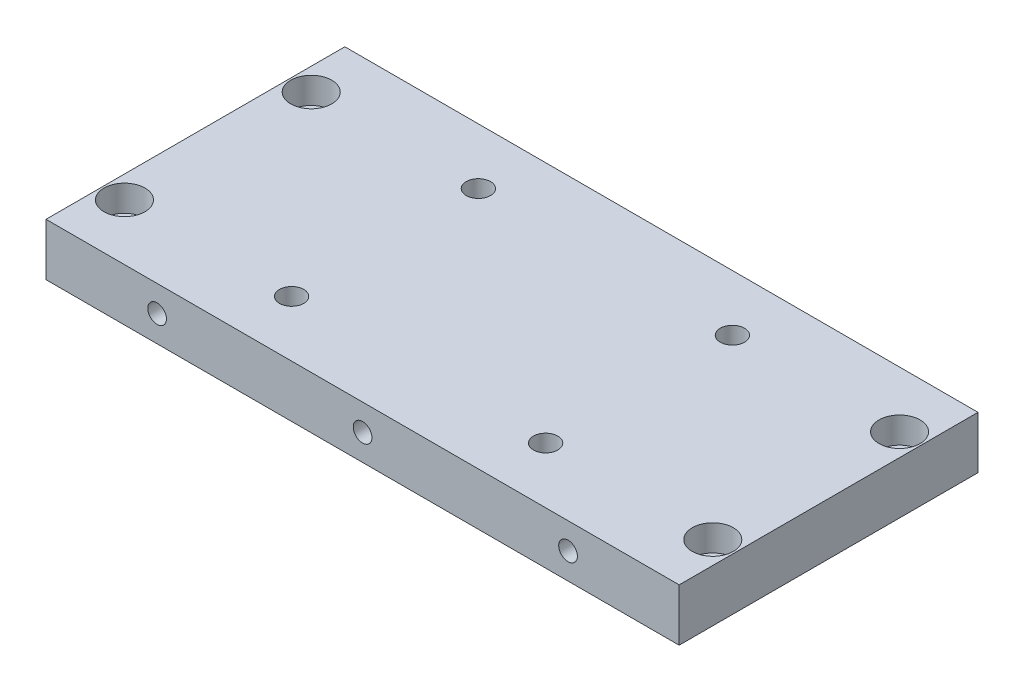
ISO-10303-21;
HEADER;
FILE_DESCRIPTION(('STEP AP214'),'2;1');
FILE_NAME('part.step','',(''),(''),'','','');
FILE_SCHEMA(('AUTOMOTIVE_DESIGN { 1 0 10303 214 1 1 1 1 }'));
ENDSEC;
DATA;
#1=APPLICATION_CONTEXT('core data for automotive mechanical design processes');
#2=APPLICATION_PROTOCOL_DEFINITION('international standard','automotive_design',2000,#1);
#3=PRODUCT_CONTEXT('',#1,'mechanical');
#4=PRODUCT('Part','Part','',(#3));
#5=PRODUCT_RELATED_PRODUCT_CATEGORY('part','',(#4));
#6=PRODUCT_DEFINITION_FORMATION('','',#4);
#7=PRODUCT_DEFINITION_CONTEXT('part definition',#1,'design');
#8=PRODUCT_DEFINITION('design','',#6,#7);
#9=PRODUCT_DEFINITION_SHAPE('','',#8);
#10=(LENGTH_UNIT() NAMED_UNIT(*) SI_UNIT(.MILLI.,.METRE.));
#11=(NAMED_UNIT(*) PLANE_ANGLE_UNIT() SI_UNIT($,.RADIAN.));
#12=(NAMED_UNIT(*) SI_UNIT($,.STERADIAN.) SOLID_ANGLE_UNIT());
#13=UNCERTAINTY_MEASURE_WITH_UNIT(LENGTH_MEASURE(1.E-05),#10,'distance_accuracy_value','');
#14=(GEOMETRIC_REPRESENTATION_CONTEXT(3) GLOBAL_UNCERTAINTY_ASSIGNED_CONTEXT((#13)) GLOBAL_UNIT_ASSIGNED_CONTEXT((#10,
#11,#12)) REPRESENTATION_CONTEXT('',''));
#15=CARTESIAN_POINT('',(0.,0.,0.));
#16=DIRECTION('',(0.,0.,1.));
#17=DIRECTION('',(1.,0.,0.));
#18=AXIS2_PLACEMENT_3D('',#15,#16,#17);
#19=CARTESIAN_POINT('',(55.,7.,23.9999999998872));
#20=DIRECTION('',(0.,0.,1.));
#21=DIRECTION('',(1.,0.,0.));
#22=AXIS2_PLACEMENT_3D('',#19,#20,#21);
#23=CONICAL_SURFACE('',#22,2.49999999989086,1.02974425861408);
#24=CARTESIAN_POINT('',(55.0000000002058,7.,22.4978484523604));
#25=VERTEX_POINT('',#24);
#26=VERTEX_LOOP('',#25);
#27=FACE_BOUND('',#26,.T.);
#28=CARTESIAN_POINT('',(55.,7.,24.));
#29=DIRECTION('',(0.,0.,1.));
#30=DIRECTION('',(1.,0.,0.));
#31=AXIS2_PLACEMENT_3D('',#28,#29,#30);
#32=CIRCLE('',#31,2.5);
#33=CARTESIAN_POINT('',(57.5,7.,24.));
#34=VERTEX_POINT('',#33);
#35=EDGE_CURVE('E69',#34,#34,#32,.T.);
#36=ORIENTED_EDGE('',*,*,#35,.T.);
#37=EDGE_LOOP('',(#36));
#38=FACE_BOUND('',#37,.T.);
#39=ADVANCED_FACE('F17',(#27,#38),#23,.F.);
#40=CARTESIAN_POINT('',(0.,7.,23.9999999999441));
#41=DIRECTION('',(0.,0.,1.));
#42=DIRECTION('',(1.,0.,0.));
#43=AXIS2_PLACEMENT_3D('',#40,#41,#42);
#44=CONICAL_SURFACE('',#43,2.49999999982219,1.02974425853634);
#45=CARTESIAN_POINT('',(0.,7.,22.4978484523604));
#46=VERTEX_POINT('',#45);
#47=VERTEX_LOOP('',#46);
#48=FACE_BOUND('',#47,.T.);
#49=CARTESIAN_POINT('',(0.,7.,24.));
#50=DIRECTION('',(0.,0.,1.));
#51=DIRECTION('',(1.,0.,0.));
#52=AXIS2_PLACEMENT_3D('',#49,#50,#51);
#53=CIRCLE('',#52,2.5);
#54=CARTESIAN_POINT('',(2.49999999999994,7.,24.));
#55=VERTEX_POINT('',#54);
#56=EDGE_CURVE('E71',#55,#55,#53,.T.);
#57=ORIENTED_EDGE('',*,*,#56,.T.);
#58=EDGE_LOOP('',(#57));
#59=FACE_BOUND('',#58,.T.);
#60=ADVANCED_FACE('F66',(#48,#59),#44,.F.);
#61=CARTESIAN_POINT('',(-55.,7.,24.0000000000578));
#62=DIRECTION('',(0.,0.,1.));
#63=DIRECTION('',(1.,0.,0.));
#64=AXIS2_PLACEMENT_3D('',#61,#62,#63);
#65=CONICAL_SURFACE('',#64,2.50000000016325,1.02974425866684);
#66=CARTESIAN_POINT('',(-55.,7.,22.4978484523604));
#67=VERTEX_POINT('',#66);
#68=VERTEX_LOOP('',#67);
#69=FACE_BOUND('',#68,.T.);
#70=CARTESIAN_POINT('',(-55.,7.,24.));
#71=DIRECTION('',(0.,0.,1.));
#72=DIRECTION('',(1.,0.,0.));
#73=AXIS2_PLACEMENT_3D('',#70,#71,#72);
#74=CIRCLE('',#73,2.5);
#75=CARTESIAN_POINT('',(-52.5,7.,24.));
#76=VERTEX_POINT('',#75);
#77=EDGE_CURVE('E75',#76,#76,#74,.T.);
#78=ORIENTED_EDGE('',*,*,#77,.T.);
#79=EDGE_LOOP('',(#78));
#80=FACE_BOUND('',#79,.T.);
#81=ADVANCED_FACE('F222',(#69,#80),#65,.F.);
#82=CARTESIAN_POINT('',(-34.,14.,25.));
#83=DIRECTION('',(0.,-1.,0.));
#84=DIRECTION('',(0.,0.,-1.));
#85=AXIS2_PLACEMENT_3D('',#82,#83,#84);
#86=CYLINDRICAL_SURFACE('',#85,3.25);
#87=CARTESIAN_POINT('',(-34.,7.,25.));
#88=DIRECTION('',(0.,-1.,0.));
#89=DIRECTION('',(0.,0.,-1.));
#90=AXIS2_PLACEMENT_3D('',#87,#88,#89);
#91=CIRCLE('',#90,3.25);
#92=CARTESIAN_POINT('',(-34.,7.,21.75));
#93=VERTEX_POINT('',#92);
#94=EDGE_CURVE('E173',#93,#93,#91,.F.);
#95=ORIENTED_EDGE('',*,*,#94,.F.);
#96=EDGE_LOOP('',(#95));
#97=FACE_BOUND('',#96,.T.);
#98=CARTESIAN_POINT('',(-34.,14.,25.));
#99=DIRECTION('',(0.,-1.,0.));
#100=DIRECTION('',(0.,0.,-1.));
#101=AXIS2_PLACEMENT_3D('',#98,#99,#100);
#102=CIRCLE('',#101,3.25);
#103=CARTESIAN_POINT('',(-34.,14.,21.75));
#104=VERTEX_POINT('',#103);
#105=EDGE_CURVE('E165',#104,#104,#102,.F.);
#106=ORIENTED_EDGE('',*,*,#105,.T.);
#107=EDGE_LOOP('',(#106));
#108=FACE_BOUND('',#107,.T.);
#109=ADVANCED_FACE('F219',(#97,#108),#86,.F.);
#110=CARTESIAN_POINT('',(-34.,14.,-25.));
#111=DIRECTION('',(0.,-1.,0.));
#112=DIRECTION('',(0.,0.,-1.));
#113=AXIS2_PLACEMENT_3D('',#110,#111,#112);
#114=CYLINDRICAL_SURFACE('',#113,3.25);
#115=CARTESIAN_POINT('',(-34.,7.,-25.));
#116=DIRECTION('',(0.,-1.,0.));
#117=DIRECTION('',(0.,0.,-1.));
#118=AXIS2_PLACEMENT_3D('',#115,#116,#117);
#119=CIRCLE('',#118,3.25);
#120=CARTESIAN_POINT('',(-34.,7.,-28.25));
#121=VERTEX_POINT('',#120);
#122=EDGE_CURVE('E78',#121,#121,#119,.F.);
#123=ORIENTED_EDGE('',*,*,#122,.F.);
#124=EDGE_LOOP('',(#123));
#125=FACE_BOUND('',#124,.T.);
#126=CARTESIAN_POINT('',(-34.,14.,-25.));
#127=DIRECTION('',(0.,-1.,0.));
#128=DIRECTION('',(0.,0.,-1.));
#129=AXIS2_PLACEMENT_3D('',#126,#127,#128);
#130=CIRCLE('',#129,3.25);
#131=CARTESIAN_POINT('',(-34.,14.,-28.25));
#132=VERTEX_POINT('',#131);
#133=EDGE_CURVE('E162',#132,#132,#130,.F.);
#134=ORIENTED_EDGE('',*,*,#133,.T.);
#135=EDGE_LOOP('',(#134));
#136=FACE_BOUND('',#135,.T.);
#137=ADVANCED_FACE('F221',(#125,#136),#114,.F.);
#138=CARTESIAN_POINT('',(34.,14.,-25.));
#139=DIRECTION('',(0.,-1.,0.));
#140=DIRECTION('',(0.,0.,-1.));
#141=AXIS2_PLACEMENT_3D('',#138,#139,#140);
#142=CYLINDRICAL_SURFACE('',#141,3.25);
#143=CARTESIAN_POINT('',(34.,7.,-25.));
#144=DIRECTION('',(0.,-1.,0.));
#145=DIRECTION('',(0.,0.,-1.));
#146=AXIS2_PLACEMENT_3D('',#143,#144,#145);
#147=CIRCLE('',#146,3.25);
#148=CARTESIAN_POINT('',(34.,7.,-28.25));
#149=VERTEX_POINT('',#148);
#150=EDGE_CURVE('E72',#149,#149,#147,.F.);
#151=ORIENTED_EDGE('',*,*,#150,.F.);
#152=EDGE_LOOP('',(#151));
#153=FACE_BOUND('',#152,.T.);
#154=CARTESIAN_POINT('',(34.,14.,-25.));
#155=DIRECTION('',(0.,-1.,0.));
#156=DIRECTION('',(0.,0.,-1.));
#157=AXIS2_PLACEMENT_3D('',#154,#155,#156);
#158=CIRCLE('',#157,3.25);
#159=CARTESIAN_POINT('',(34.,14.,-28.25));
#160=VERTEX_POINT('',#159);
#161=EDGE_CURVE('E159',#160,#160,#158,.F.);
#162=ORIENTED_EDGE('',*,*,#161,.T.);
#163=EDGE_LOOP('',(#162));
#164=FACE_BOUND('',#163,.T.);
#165=ADVANCED_FACE('F230',(#153,#164),#142,.F.);
#166=CARTESIAN_POINT('',(34.,14.,25.));
#167=DIRECTION('',(0.,-1.,0.));
#168=DIRECTION('',(0.,0.,-1.));
#169=AXIS2_PLACEMENT_3D('',#166,#167,#168);
#170=CYLINDRICAL_SURFACE('',#169,3.25);
#171=CARTESIAN_POINT('',(34.,7.,25.));
#172=DIRECTION('',(0.,-1.,0.));
#173=DIRECTION('',(0.,0.,-1.));
#174=AXIS2_PLACEMENT_3D('',#171,#172,#173);
#175=CIRCLE('',#174,3.25);
#176=CARTESIAN_POINT('',(34.,7.,21.75));
#177=VERTEX_POINT('',#176);
#178=EDGE_CURVE('E170',#177,#177,#175,.F.);
#179=ORIENTED_EDGE('',*,*,#178,.F.);
#180=EDGE_LOOP('',(#179));
#181=FACE_BOUND('',#180,.T.);
#182=CARTESIAN_POINT('',(34.,14.,25.));
#183=DIRECTION('',(0.,-1.,0.));
#184=DIRECTION('',(0.,0.,-1.));
#185=AXIS2_PLACEMENT_3D('',#182,#183,#184);
#186=CIRCLE('',#185,3.25);
#187=CARTESIAN_POINT('',(34.,14.,21.75));
#188=VERTEX_POINT('',#187);
#189=EDGE_CURVE('E156',#188,#188,#186,.F.);
#190=ORIENTED_EDGE('',*,*,#189,.T.);
#191=EDGE_LOOP('',(#190));
#192=FACE_BOUND('',#191,.T.);
#193=ADVANCED_FACE('F340',(#181,#192),#170,.F.);
#194=CARTESIAN_POINT('',(-78.75,7.,-25.));
#195=DIRECTION('',(0.,1.,0.));
#196=DIRECTION('',(0.,0.,1.));
#197=AXIS2_PLACEMENT_3D('',#194,#195,#196);
#198=CYLINDRICAL_SURFACE('',#197,5.5);
#199=CARTESIAN_POINT('',(-78.75,7.,-25.));
#200=DIRECTION('',(0.,1.,0.));
#201=DIRECTION('',(0.,0.,1.));
#202=AXIS2_PLACEMENT_3D('',#199,#200,#201);
#203=CIRCLE('',#202,5.5);
#204=CARTESIAN_POINT('',(-78.75,7.,-19.5));
#205=VERTEX_POINT('',#204);
#206=EDGE_CURVE('E179',#205,#205,#203,.T.);
#207=ORIENTED_EDGE('',*,*,#206,.F.);
#208=EDGE_LOOP('',(#207));
#209=FACE_BOUND('',#208,.T.);
#210=CARTESIAN_POINT('',(-78.75,14.,-25.));
#211=DIRECTION('',(0.,1.,0.));
#212=DIRECTION('',(0.,0.,1.));
#213=AXIS2_PLACEMENT_3D('',#210,#211,#212);
#214=CIRCLE('',#213,5.5);
#215=CARTESIAN_POINT('',(-78.75,14.,-19.5));
#216=VERTEX_POINT('',#215);
#217=EDGE_CURVE('E153',#216,#216,#214,.T.);
#218=ORIENTED_EDGE('',*,*,#217,.T.);
#219=EDGE_LOOP('',(#218));
#220=FACE_BOUND('',#219,.T.);
#221=ADVANCED_FACE('F336',(#209,#220),#198,.F.);
#222=CARTESIAN_POINT('',(-78.75,7.,25.));
#223=DIRECTION('',(0.,1.,0.));
#224=DIRECTION('',(0.,0.,1.));
#225=AXIS2_PLACEMENT_3D('',#222,#223,#224);
#226=CYLINDRICAL_SURFACE('',#225,5.5);
#227=CARTESIAN_POINT('',(-78.75,7.,25.));
#228=DIRECTION('',(0.,1.,0.));
#229=DIRECTION('',(0.,0.,1.));
#230=AXIS2_PLACEMENT_3D('',#227,#228,#229);
#231=CIRCLE('',#230,5.5);
#232=CARTESIAN_POINT('',(-78.75,7.,30.5));
#233=VERTEX_POINT('',#232);
#234=EDGE_CURVE('E176',#233,#233,#231,.T.);
#235=ORIENTED_EDGE('',*,*,#234,.F.);
#236=EDGE_LOOP('',(#235));
#237=FACE_BOUND('',#236,.T.);
#238=CARTESIAN_POINT('',(-78.75,14.,25.));
#239=DIRECTION('',(0.,1.,0.));
#240=DIRECTION('',(0.,0.,1.));
#241=AXIS2_PLACEMENT_3D('',#238,#239,#240);
#242=CIRCLE('',#241,5.5);
#243=CARTESIAN_POINT('',(-78.75,14.,30.5));
#244=VERTEX_POINT('',#243);
#245=EDGE_CURVE('E150',#244,#244,#242,.T.);
#246=ORIENTED_EDGE('',*,*,#245,.T.);
#247=EDGE_LOOP('',(#246));
#248=FACE_BOUND('',#247,.T.);
#249=ADVANCED_FACE('F332',(#237,#248),#226,.F.);
#250=CARTESIAN_POINT('',(78.75,7.,-25.));
#251=DIRECTION('',(0.,1.,0.));
#252=DIRECTION('',(0.,0.,1.));
#253=AXIS2_PLACEMENT_3D('',#250,#251,#252);
#254=CYLINDRICAL_SURFACE('',#253,5.5);
#255=CARTESIAN_POINT('',(78.75,7.,-25.));
#256=DIRECTION('',(0.,1.,0.));
#257=DIRECTION('',(0.,0.,1.));
#258=AXIS2_PLACEMENT_3D('',#255,#256,#257);
#259=CIRCLE('',#258,5.5);
#260=CARTESIAN_POINT('',(78.75,7.,-19.5));
#261=VERTEX_POINT('',#260);
#262=EDGE_CURVE('E181',#261,#261,#259,.T.);
#263=ORIENTED_EDGE('',*,*,#262,.F.);
#264=EDGE_LOOP('',(#263));
#265=FACE_BOUND('',#264,.T.);
#266=CARTESIAN_POINT('',(78.75,14.,-25.));
#267=DIRECTION('',(0.,1.,0.));
#268=DIRECTION('',(0.,0.,1.));
#269=AXIS2_PLACEMENT_3D('',#266,#267,#268);
#270=CIRCLE('',#269,5.5);
#271=CARTESIAN_POINT('',(78.75,14.,-19.5));
#272=VERTEX_POINT('',#271);
#273=EDGE_CURVE('E147',#272,#272,#270,.T.);
#274=ORIENTED_EDGE('',*,*,#273,.T.);
#275=EDGE_LOOP('',(#274));
#276=FACE_BOUND('',#275,.T.);
#277=ADVANCED_FACE('F194',(#265,#276),#254,.F.);
#278=CARTESIAN_POINT('',(78.75,7.,25.));
#279=DIRECTION('',(0.,1.,0.));
#280=DIRECTION('',(0.,0.,1.));
#281=AXIS2_PLACEMENT_3D('',#278,#279,#280);
#282=CYLINDRICAL_SURFACE('',#281,5.5);
#283=CARTESIAN_POINT('',(78.75,7.,25.));
#284=DIRECTION('',(0.,1.,0.));
#285=DIRECTION('',(0.,0.,1.));
#286=AXIS2_PLACEMENT_3D('',#283,#284,#285);
#287=CIRCLE('',#286,5.5);
#288=CARTESIAN_POINT('',(78.75,7.,30.5));
#289=VERTEX_POINT('',#288);
#290=EDGE_CURVE('E20',#289,#289,#287,.T.);
#291=ORIENTED_EDGE('',*,*,#290,.F.);
#292=EDGE_LOOP('',(#291));
#293=FACE_BOUND('',#292,.T.);
#294=CARTESIAN_POINT('',(78.75,14.,25.));
#295=DIRECTION('',(0.,1.,0.));
#296=DIRECTION('',(0.,0.,1.));
#297=AXIS2_PLACEMENT_3D('',#294,#295,#296);
#298=CIRCLE('',#297,5.5);
#299=CARTESIAN_POINT('',(78.75,14.,30.5));
#300=VERTEX_POINT('',#299);
#301=EDGE_CURVE('E144',#300,#300,#298,.T.);
#302=ORIENTED_EDGE('',*,*,#301,.T.);
#303=EDGE_LOOP('',(#302));
#304=FACE_BOUND('',#303,.T.);
#305=ADVANCED_FACE('F191',(#293,#304),#282,.F.);
#306=CARTESIAN_POINT('',(78.75,7.,25.));
#307=DIRECTION('',(0.,1.,0.));
#308=DIRECTION('',(0.,0.,1.));
#309=AXIS2_PLACEMENT_3D('',#306,#307,#308);
#310=PLANE('',#309);
#311=ORIENTED_EDGE('',*,*,#290,.T.);
#312=EDGE_LOOP('',(#311));
#313=FACE_BOUND('',#312,.T.);
#314=CARTESIAN_POINT('',(78.75,7.,25.));
#315=DIRECTION('',(0.,-1.,0.));
#316=DIRECTION('',(0.,0.,-1.));
#317=AXIS2_PLACEMENT_3D('',#314,#315,#316);
#318=CIRCLE('',#317,3.25);
#319=CARTESIAN_POINT('',(78.75,7.,21.75));
#320=VERTEX_POINT('',#319);
#321=EDGE_CURVE('E141',#320,#320,#318,.T.);
#322=ORIENTED_EDGE('',*,*,#321,.T.);
#323=EDGE_LOOP('',(#322));
#324=FACE_BOUND('',#323,.T.);
#325=ADVANCED_FACE('F188',(#313,#324),#310,.T.);
#326=CARTESIAN_POINT('',(78.75,7.,-25.));
#327=DIRECTION('',(0.,1.,0.));
#328=DIRECTION('',(0.,0.,1.));
#329=AXIS2_PLACEMENT_3D('',#326,#327,#328);
#330=PLANE('',#329);
#331=ORIENTED_EDGE('',*,*,#262,.T.);
#332=EDGE_LOOP('',(#331));
#333=FACE_BOUND('',#332,.T.);
#334=CARTESIAN_POINT('',(78.75,7.,-25.));
#335=DIRECTION('',(0.,-1.,0.));
#336=DIRECTION('',(0.,0.,-1.));
#337=AXIS2_PLACEMENT_3D('',#334,#335,#336);
#338=CIRCLE('',#337,3.25);
#339=CARTESIAN_POINT('',(78.75,7.,-28.25));
#340=VERTEX_POINT('',#339);
#341=EDGE_CURVE('E138',#340,#340,#338,.T.);
#342=ORIENTED_EDGE('',*,*,#341,.T.);
#343=EDGE_LOOP('',(#342));
#344=FACE_BOUND('',#343,.T.);
#345=ADVANCED_FACE('F324',(#333,#344),#330,.T.);
#346=CARTESIAN_POINT('',(-78.75,7.,-25.));
#347=DIRECTION('',(0.,1.,0.));
#348=DIRECTION('',(0.,0.,1.));
#349=AXIS2_PLACEMENT_3D('',#346,#347,#348);
#350=PLANE('',#349);
#351=ORIENTED_EDGE('',*,*,#206,.T.);
#352=EDGE_LOOP('',(#351));
#353=FACE_BOUND('',#352,.T.);
#354=CARTESIAN_POINT('',(-78.75,7.,-25.));
#355=DIRECTION('',(0.,-1.,0.));
#356=DIRECTION('',(0.,0.,-1.));
#357=AXIS2_PLACEMENT_3D('',#354,#355,#356);
#358=CIRCLE('',#357,3.25);
#359=CARTESIAN_POINT('',(-78.75,7.,-28.25));
#360=VERTEX_POINT('',#359);
#361=EDGE_CURVE('E135',#360,#360,#358,.T.);
#362=ORIENTED_EDGE('',*,*,#361,.T.);
#363=EDGE_LOOP('',(#362));
#364=FACE_BOUND('',#363,.T.);
#365=ADVANCED_FACE('F320',(#353,#364),#350,.T.);
#366=CARTESIAN_POINT('',(-78.75,7.,25.));
#367=DIRECTION('',(0.,1.,0.));
#368=DIRECTION('',(0.,0.,1.));
#369=AXIS2_PLACEMENT_3D('',#366,#367,#368);
#370=PLANE('',#369);
#371=ORIENTED_EDGE('',*,*,#234,.T.);
#372=EDGE_LOOP('',(#371));
#373=FACE_BOUND('',#372,.T.);
#374=CARTESIAN_POINT('',(-78.75,7.,25.));
#375=DIRECTION('',(0.,-1.,0.));
#376=DIRECTION('',(0.,0.,-1.));
#377=AXIS2_PLACEMENT_3D('',#374,#375,#376);
#378=CIRCLE('',#377,3.25);
#379=CARTESIAN_POINT('',(-78.75,7.,21.75));
#380=VERTEX_POINT('',#379);
#381=EDGE_CURVE('E132',#380,#380,#378,.T.);
#382=ORIENTED_EDGE('',*,*,#381,.T.);
#383=EDGE_LOOP('',(#382));
#384=FACE_BOUND('',#383,.T.);
#385=ADVANCED_FACE('F316',(#373,#384),#370,.T.);
#386=CARTESIAN_POINT('',(-34.,7.,25.));
#387=DIRECTION('',(0.,-1.,0.));
#388=DIRECTION('',(0.,0.,-1.));
#389=AXIS2_PLACEMENT_3D('',#386,#387,#388);
#390=PLANE('',#389);
#391=CARTESIAN_POINT('',(-34.,7.,25.));
#392=DIRECTION('',(0.,-1.,0.));
#393=DIRECTION('',(0.,0.,-1.));
#394=AXIS2_PLACEMENT_3D('',#391,#392,#393);
#395=CIRCLE('',#394,5.5);
#396=CARTESIAN_POINT('',(-34.,7.,19.5));
#397=VERTEX_POINT('',#396);
#398=EDGE_CURVE('E129',#397,#397,#395,.T.);
#399=ORIENTED_EDGE('',*,*,#398,.T.);
#400=EDGE_LOOP('',(#399));
#401=FACE_BOUND('',#400,.T.);
#402=ORIENTED_EDGE('',*,*,#94,.T.);
#403=EDGE_LOOP('',(#402));
#404=FACE_BOUND('',#403,.T.);
#405=ADVANCED_FACE('F312',(#401,#404),#390,.T.);
#406=CARTESIAN_POINT('',(34.,7.,25.));
#407=DIRECTION('',(0.,-1.,0.));
#408=DIRECTION('',(0.,0.,-1.));
#409=AXIS2_PLACEMENT_3D('',#406,#407,#408);
#410=PLANE('',#409);
#411=CARTESIAN_POINT('',(34.,7.,25.));
#412=DIRECTION('',(0.,-1.,0.));
#413=DIRECTION('',(0.,0.,-1.));
#414=AXIS2_PLACEMENT_3D('',#411,#412,#413);
#415=CIRCLE('',#414,5.5);
#416=CARTESIAN_POINT('',(34.,7.,19.5));
#417=VERTEX_POINT('',#416);
#418=EDGE_CURVE('E126',#417,#417,#415,.T.);
#419=ORIENTED_EDGE('',*,*,#418,.T.);
#420=EDGE_LOOP('',(#419));
#421=FACE_BOUND('',#420,.T.);
#422=ORIENTED_EDGE('',*,*,#178,.T.);
#423=EDGE_LOOP('',(#422));
#424=FACE_BOUND('',#423,.T.);
#425=ADVANCED_FACE('F308',(#421,#424),#410,.T.);
#426=CARTESIAN_POINT('',(-34.,7.,-25.));
#427=DIRECTION('',(0.,-1.,0.));
#428=DIRECTION('',(0.,0.,-1.));
#429=AXIS2_PLACEMENT_3D('',#426,#427,#428);
#430=PLANE('',#429);
#431=CARTESIAN_POINT('',(-34.,7.,-25.));
#432=DIRECTION('',(0.,-1.,0.));
#433=DIRECTION('',(0.,0.,-1.));
#434=AXIS2_PLACEMENT_3D('',#431,#432,#433);
#435=CIRCLE('',#434,5.5);
#436=CARTESIAN_POINT('',(-34.,7.,-30.5));
#437=VERTEX_POINT('',#436);
#438=EDGE_CURVE('E123',#437,#437,#435,.T.);
#439=ORIENTED_EDGE('',*,*,#438,.T.);
#440=EDGE_LOOP('',(#439));
#441=FACE_BOUND('',#440,.T.);
#442=ORIENTED_EDGE('',*,*,#122,.T.);
#443=EDGE_LOOP('',(#442));
#444=FACE_BOUND('',#443,.T.);
#445=ADVANCED_FACE('F304',(#441,#444),#430,.T.);
#446=CARTESIAN_POINT('',(34.,7.,-25.));
#447=DIRECTION('',(0.,-1.,0.));
#448=DIRECTION('',(0.,0.,-1.));
#449=AXIS2_PLACEMENT_3D('',#446,#447,#448);
#450=PLANE('',#449);
#451=CARTESIAN_POINT('',(34.,7.,-25.));
#452=DIRECTION('',(0.,-1.,0.));
#453=DIRECTION('',(0.,0.,-1.));
#454=AXIS2_PLACEMENT_3D('',#451,#452,#453);
#455=CIRCLE('',#454,5.5);
#456=CARTESIAN_POINT('',(34.,7.,-30.5));
#457=VERTEX_POINT('',#456);
#458=EDGE_CURVE('E119',#457,#457,#455,.T.);
#459=ORIENTED_EDGE('',*,*,#458,.T.);
#460=EDGE_LOOP('',(#459));
#461=FACE_BOUND('',#460,.T.);
#462=ORIENTED_EDGE('',*,*,#150,.T.);
#463=EDGE_LOOP('',(#462));
#464=FACE_BOUND('',#463,.T.);
#465=ADVANCED_FACE('F301',(#461,#464),#450,.T.);
#466=CARTESIAN_POINT('',(55.,7.,40.));
#467=DIRECTION('',(0.,0.,1.));
#468=DIRECTION('',(1.,0.,0.));
#469=AXIS2_PLACEMENT_3D('',#466,#467,#468);
#470=CYLINDRICAL_SURFACE('',#469,2.5);
#471=ORIENTED_EDGE('',*,*,#35,.F.);
#472=EDGE_LOOP('',(#471));
#473=FACE_BOUND('',#472,.T.);
#474=CARTESIAN_POINT('',(55.,7.,40.));
#475=DIRECTION('',(0.,0.,1.));
#476=DIRECTION('',(1.,0.,0.));
#477=AXIS2_PLACEMENT_3D('',#474,#475,#476);
#478=CIRCLE('',#477,2.5);
#479=CARTESIAN_POINT('',(57.5,7.,40.));
#480=VERTEX_POINT('',#479);
#481=EDGE_CURVE('E115',#480,#480,#478,.T.);
#482=ORIENTED_EDGE('',*,*,#481,.T.);
#483=EDGE_LOOP('',(#482));
#484=FACE_BOUND('',#483,.T.);
#485=ADVANCED_FACE('F297',(#473,#484),#470,.F.);
#486=CARTESIAN_POINT('',(0.,7.,40.));
#487=DIRECTION('',(0.,0.,1.));
#488=DIRECTION('',(1.,0.,0.));
#489=AXIS2_PLACEMENT_3D('',#486,#487,#488);
#490=CYLINDRICAL_SURFACE('',#489,2.5);
#491=ORIENTED_EDGE('',*,*,#56,.F.);
#492=EDGE_LOOP('',(#491));
#493=FACE_BOUND('',#492,.T.);
#494=CARTESIAN_POINT('',(0.,7.,40.));
#495=DIRECTION('',(0.,0.,1.));
#496=DIRECTION('',(1.,0.,0.));
#497=AXIS2_PLACEMENT_3D('',#494,#495,#496);
#498=CIRCLE('',#497,2.5);
#499=CARTESIAN_POINT('',(2.49999999999994,7.,40.));
#500=VERTEX_POINT('',#499);
#501=EDGE_CURVE('E112',#500,#500,#498,.T.);
#502=ORIENTED_EDGE('',*,*,#501,.T.);
#503=EDGE_LOOP('',(#502));
#504=FACE_BOUND('',#503,.T.);
#505=ADVANCED_FACE('F293',(#493,#504),#490,.F.);
#506=CARTESIAN_POINT('',(-55.,7.,40.));
#507=DIRECTION('',(0.,0.,1.));
#508=DIRECTION('',(1.,0.,0.));
#509=AXIS2_PLACEMENT_3D('',#506,#507,#508);
#510=CYLINDRICAL_SURFACE('',#509,2.5);
#511=ORIENTED_EDGE('',*,*,#77,.F.);
#512=EDGE_LOOP('',(#511));
#513=FACE_BOUND('',#512,.T.);
#514=CARTESIAN_POINT('',(-55.,7.,40.));
#515=DIRECTION('',(0.,0.,1.));
#516=DIRECTION('',(1.,0.,0.));
#517=AXIS2_PLACEMENT_3D('',#514,#515,#516);
#518=CIRCLE('',#517,2.5);
#519=CARTESIAN_POINT('',(-52.5,7.,40.));
#520=VERTEX_POINT('',#519);
#521=EDGE_CURVE('E108',#520,#520,#518,.T.);
#522=ORIENTED_EDGE('',*,*,#521,.T.);
#523=EDGE_LOOP('',(#522));
#524=FACE_BOUND('',#523,.T.);
#525=ADVANCED_FACE('F202',(#513,#524),#510,.F.);
#526=CARTESIAN_POINT('',(84.75,14.,40.));
#527=DIRECTION('',(0.,-1.,0.));
#528=DIRECTION('',(0.,0.,-1.));
#529=AXIS2_PLACEMENT_3D('',#526,#527,#528);
#530=PLANE('',#529);
#531=DIRECTION('',(-1.,0.,0.));
#532=VECTOR('',#531,1.);
#533=CARTESIAN_POINT('',(84.75,14.,40.));
#534=LINE('',#533,#532);
#535=CARTESIAN_POINT('',(-84.75,14.,40.));
#536=VERTEX_POINT('',#535);
#537=CARTESIAN_POINT('',(84.75,14.,40.));
#538=VERTEX_POINT('',#537);
#539=EDGE_CURVE('E641',#536,#538,#534,.F.);
#540=ORIENTED_EDGE('',*,*,#539,.T.);
#541=DIRECTION('',(0.,0.,1.));
#542=VECTOR('',#541,1.);
#543=CARTESIAN_POINT('',(84.75,14.,-40.));
#544=LINE('',#543,#542);
#545=CARTESIAN_POINT('',(84.75,14.,-40.));
#546=VERTEX_POINT('',#545);
#547=EDGE_CURVE('E118',#538,#546,#544,.F.);
#548=ORIENTED_EDGE('',*,*,#547,.T.);
#549=DIRECTION('',(1.,0.,0.));
#550=VECTOR('',#549,1.);
#551=CARTESIAN_POINT('',(84.75,14.,-40.));
#552=LINE('',#551,#550);
#553=CARTESIAN_POINT('',(-84.75,14.,-40.));
#554=VERTEX_POINT('',#553);
#555=EDGE_CURVE('E122',#546,#554,#552,.F.);
#556=ORIENTED_EDGE('',*,*,#555,.T.);
#557=DIRECTION('',(0.,0.,-1.));
#558=VECTOR('',#557,1.);
#559=CARTESIAN_POINT('',(-84.75,14.,40.));
#560=LINE('',#559,#558);
#561=EDGE_CURVE('E107',#554,#536,#560,.F.);
#562=ORIENTED_EDGE('',*,*,#561,.T.);
#563=EDGE_LOOP('',(#540,#548,#556,#562));
#564=FACE_BOUND('',#563,.T.);
#565=ORIENTED_EDGE('',*,*,#301,.F.);
#566=EDGE_LOOP('',(#565));
#567=FACE_BOUND('',#566,.T.);
#568=ORIENTED_EDGE('',*,*,#273,.F.);
#569=EDGE_LOOP('',(#568));
#570=FACE_BOUND('',#569,.T.);
#571=ORIENTED_EDGE('',*,*,#245,.F.);
#572=EDGE_LOOP('',(#571));
#573=FACE_BOUND('',#572,.T.);
#574=ORIENTED_EDGE('',*,*,#217,.F.);
#575=EDGE_LOOP('',(#574));
#576=FACE_BOUND('',#575,.T.);
#577=ORIENTED_EDGE('',*,*,#189,.F.);
#578=EDGE_LOOP('',(#577));
#579=FACE_BOUND('',#578,.T.);
#580=ORIENTED_EDGE('',*,*,#161,.F.);
#581=EDGE_LOOP('',(#580));
#582=FACE_BOUND('',#581,.T.);
#583=ORIENTED_EDGE('',*,*,#133,.F.);
#584=EDGE_LOOP('',(#583));
#585=FACE_BOUND('',#584,.T.);
#586=ORIENTED_EDGE('',*,*,#105,.F.);
#587=EDGE_LOOP('',(#586));
#588=FACE_BOUND('',#587,.T.);
#589=ADVANCED_FACE('F198',(#564,#567,#570,#573,#576,#579,#582,#585,#588),#530,.F.);
#590=CARTESIAN_POINT('',(78.75,14.,25.));
#591=DIRECTION('',(0.,-1.,0.));
#592=DIRECTION('',(0.,0.,-1.));
#593=AXIS2_PLACEMENT_3D('',#590,#591,#592);
#594=CYLINDRICAL_SURFACE('',#593,3.25);
#595=ORIENTED_EDGE('',*,*,#321,.F.);
#596=EDGE_LOOP('',(#595));
#597=FACE_BOUND('',#596,.T.);
#598=CARTESIAN_POINT('',(78.75,0.,25.));
#599=DIRECTION('',(0.,-1.,0.));
#600=DIRECTION('',(0.,0.,-1.));
#601=AXIS2_PLACEMENT_3D('',#598,#599,#600);
#602=CIRCLE('',#601,3.25);
#603=CARTESIAN_POINT('',(78.75,0.,21.75));
#604=VERTEX_POINT('',#603);
#605=EDGE_CURVE('E104',#604,#604,#602,.F.);
#606=ORIENTED_EDGE('',*,*,#605,.F.);
#607=EDGE_LOOP('',(#606));
#608=FACE_BOUND('',#607,.T.);
#609=ADVANCED_FACE('F201',(#597,#608),#594,.F.);
#610=CARTESIAN_POINT('',(78.75,14.,-25.));
#611=DIRECTION('',(0.,-1.,0.));
#612=DIRECTION('',(0.,0.,-1.));
#613=AXIS2_PLACEMENT_3D('',#610,#611,#612);
#614=CYLINDRICAL_SURFACE('',#613,3.25);
#615=ORIENTED_EDGE('',*,*,#341,.F.);
#616=EDGE_LOOP('',(#615));
#617=FACE_BOUND('',#616,.T.);
#618=CARTESIAN_POINT('',(78.75,0.,-25.));
#619=DIRECTION('',(0.,-1.,0.));
#620=DIRECTION('',(0.,0.,-1.));
#621=AXIS2_PLACEMENT_3D('',#618,#619,#620);
#622=CIRCLE('',#621,3.25);
#623=CARTESIAN_POINT('',(78.75,0.,-28.25));
#624=VERTEX_POINT('',#623);
#625=EDGE_CURVE('E101',#624,#624,#622,.F.);
#626=ORIENTED_EDGE('',*,*,#625,.F.);
#627=EDGE_LOOP('',(#626));
#628=FACE_BOUND('',#627,.T.);
#629=ADVANCED_FACE('F283',(#617,#628),#614,.F.);
#630=CARTESIAN_POINT('',(-78.75,14.,-25.));
#631=DIRECTION('',(0.,-1.,0.));
#632=DIRECTION('',(0.,0.,-1.));
#633=AXIS2_PLACEMENT_3D('',#630,#631,#632);
#634=CYLINDRICAL_SURFACE('',#633,3.25);
#635=ORIENTED_EDGE('',*,*,#361,.F.);
#636=EDGE_LOOP('',(#635));
#637=FACE_BOUND('',#636,.T.);
#638=CARTESIAN_POINT('',(-78.75,0.,-25.));
#639=DIRECTION('',(0.,-1.,0.));
#640=DIRECTION('',(0.,0.,-1.));
#641=AXIS2_PLACEMENT_3D('',#638,#639,#640);
#642=CIRCLE('',#641,3.25);
#643=CARTESIAN_POINT('',(-78.75,0.,-28.25));
#644=VERTEX_POINT('',#643);
#645=EDGE_CURVE('E98',#644,#644,#642,.F.);
#646=ORIENTED_EDGE('',*,*,#645,.F.);
#647=EDGE_LOOP('',(#646));
#648=FACE_BOUND('',#647,.T.);
#649=ADVANCED_FACE('F279',(#637,#648),#634,.F.);
#650=CARTESIAN_POINT('',(-78.75,14.,25.));
#651=DIRECTION('',(0.,-1.,0.));
#652=DIRECTION('',(0.,0.,-1.));
#653=AXIS2_PLACEMENT_3D('',#650,#651,#652);
#654=CYLINDRICAL_SURFACE('',#653,3.25);
#655=ORIENTED_EDGE('',*,*,#381,.F.);
#656=EDGE_LOOP('',(#655));
#657=FACE_BOUND('',#656,.T.);
#658=CARTESIAN_POINT('',(-78.75,0.,25.));
#659=DIRECTION('',(0.,-1.,0.));
#660=DIRECTION('',(0.,0.,-1.));
#661=AXIS2_PLACEMENT_3D('',#658,#659,#660);
#662=CIRCLE('',#661,3.25);
#663=CARTESIAN_POINT('',(-78.75,0.,21.75));
#664=VERTEX_POINT('',#663);
#665=EDGE_CURVE('E95',#664,#664,#662,.F.);
#666=ORIENTED_EDGE('',*,*,#665,.F.);
#667=EDGE_LOOP('',(#666));
#668=FACE_BOUND('',#667,.T.);
#669=ADVANCED_FACE('F275',(#657,#668),#654,.F.);
#670=CARTESIAN_POINT('',(-34.,7.,25.));
#671=DIRECTION('',(0.,-1.,0.));
#672=DIRECTION('',(0.,0.,-1.));
#673=AXIS2_PLACEMENT_3D('',#670,#671,#672);
#674=CYLINDRICAL_SURFACE('',#673,5.5);
#675=ORIENTED_EDGE('',*,*,#398,.F.);
#676=EDGE_LOOP('',(#675));
#677=FACE_BOUND('',#676,.T.);
#678=CARTESIAN_POINT('',(-34.,0.,25.));
#679=DIRECTION('',(0.,-1.,0.));
#680=DIRECTION('',(0.,0.,-1.));
#681=AXIS2_PLACEMENT_3D('',#678,#679,#680);
#682=CIRCLE('',#681,5.5);
#683=CARTESIAN_POINT('',(-34.,0.,19.5));
#684=VERTEX_POINT('',#683);
#685=EDGE_CURVE('E92',#684,#684,#682,.F.);
#686=ORIENTED_EDGE('',*,*,#685,.F.);
#687=EDGE_LOOP('',(#686));
#688=FACE_BOUND('',#687,.T.);
#689=ADVANCED_FACE('F271',(#677,#688),#674,.F.);
#690=CARTESIAN_POINT('',(34.,7.,25.));
#691=DIRECTION('',(0.,-1.,0.));
#692=DIRECTION('',(0.,0.,-1.));
#693=AXIS2_PLACEMENT_3D('',#690,#691,#692);
#694=CYLINDRICAL_SURFACE('',#693,5.5);
#695=ORIENTED_EDGE('',*,*,#418,.F.);
#696=EDGE_LOOP('',(#695));
#697=FACE_BOUND('',#696,.T.);
#698=CARTESIAN_POINT('',(34.,0.,25.));
#699=DIRECTION('',(0.,-1.,0.));
#700=DIRECTION('',(0.,0.,-1.));
#701=AXIS2_PLACEMENT_3D('',#698,#699,#700);
#702=CIRCLE('',#701,5.5);
#703=CARTESIAN_POINT('',(34.,0.,19.5));
#704=VERTEX_POINT('',#703);
#705=EDGE_CURVE('E89',#704,#704,#702,.F.);
#706=ORIENTED_EDGE('',*,*,#705,.F.);
#707=EDGE_LOOP('',(#706));
#708=FACE_BOUND('',#707,.T.);
#709=ADVANCED_FACE('F267',(#697,#708),#694,.F.);
#710=CARTESIAN_POINT('',(-34.,7.,-25.));
#711=DIRECTION('',(0.,-1.,0.));
#712=DIRECTION('',(0.,0.,-1.));
#713=AXIS2_PLACEMENT_3D('',#710,#711,#712);
#714=CYLINDRICAL_SURFACE('',#713,5.5);
#715=ORIENTED_EDGE('',*,*,#438,.F.);
#716=EDGE_LOOP('',(#715));
#717=FACE_BOUND('',#716,.T.);
#718=CARTESIAN_POINT('',(-34.,0.,-25.));
#719=DIRECTION('',(0.,-1.,0.));
#720=DIRECTION('',(0.,0.,-1.));
#721=AXIS2_PLACEMENT_3D('',#718,#719,#720);
#722=CIRCLE('',#721,5.5);
#723=CARTESIAN_POINT('',(-34.,0.,-30.5));
#724=VERTEX_POINT('',#723);
#725=EDGE_CURVE('E86',#724,#724,#722,.F.);
#726=ORIENTED_EDGE('',*,*,#725,.F.);
#727=EDGE_LOOP('',(#726));
#728=FACE_BOUND('',#727,.T.);
#729=ADVANCED_FACE('F263',(#717,#728),#714,.F.);
#730=CARTESIAN_POINT('',(34.,7.,-25.));
#731=DIRECTION('',(0.,-1.,0.));
#732=DIRECTION('',(0.,0.,-1.));
#733=AXIS2_PLACEMENT_3D('',#730,#731,#732);
#734=CYLINDRICAL_SURFACE('',#733,5.5);
#735=ORIENTED_EDGE('',*,*,#458,.F.);
#736=EDGE_LOOP('',(#735));
#737=FACE_BOUND('',#736,.T.);
#738=CARTESIAN_POINT('',(34.,0.,-25.));
#739=DIRECTION('',(0.,-1.,0.));
#740=DIRECTION('',(0.,0.,-1.));
#741=AXIS2_PLACEMENT_3D('',#738,#739,#740);
#742=CIRCLE('',#741,5.5);
#743=CARTESIAN_POINT('',(34.,0.,-30.5));
#744=VERTEX_POINT('',#743);
#745=EDGE_CURVE('E82',#744,#744,#742,.F.);
#746=ORIENTED_EDGE('',*,*,#745,.F.);
#747=EDGE_LOOP('',(#746));
#748=FACE_BOUND('',#747,.T.);
#749=ADVANCED_FACE('F259',(#737,#748),#734,.F.);
#750=CARTESIAN_POINT('',(84.75,14.,-40.));
#751=DIRECTION('',(0.,0.,1.));
#752=DIRECTION('',(1.,0.,0.));
#753=AXIS2_PLACEMENT_3D('',#750,#751,#752);
#754=PLANE('',#753);
#755=DIRECTION('',(0.,1.,0.));
#756=VECTOR('',#755,1.);
#757=CARTESIAN_POINT('',(84.75,14.,-40.));
#758=LINE('',#757,#756);
#759=CARTESIAN_POINT('',(84.75,0.,-40.));
#760=VERTEX_POINT('',#759);
#761=EDGE_CURVE('E636',#546,#760,#758,.F.);
#762=ORIENTED_EDGE('',*,*,#761,.T.);
#763=DIRECTION('',(1.,0.,0.));
#764=VECTOR('',#763,1.);
#765=CARTESIAN_POINT('',(84.75,0.,-40.));
#766=LINE('',#765,#764);
#767=CARTESIAN_POINT('',(-84.75,0.,-40.));
#768=VERTEX_POINT('',#767);
#769=EDGE_CURVE('E85',#768,#760,#766,.T.);
#770=ORIENTED_EDGE('',*,*,#769,.F.);
#771=DIRECTION('',(0.,1.,0.));
#772=VECTOR('',#771,1.);
#773=CARTESIAN_POINT('',(-84.75,14.,-40.));
#774=LINE('',#773,#772);
#775=EDGE_CURVE('E645',#768,#554,#774,.T.);
#776=ORIENTED_EDGE('',*,*,#775,.T.);
#777=ORIENTED_EDGE('',*,*,#555,.F.);
#778=EDGE_LOOP('',(#762,#770,#776,#777));
#779=FACE_BOUND('',#778,.T.);
#780=ADVANCED_FACE('F255',(#779),#754,.F.);
#781=CARTESIAN_POINT('',(84.75,14.,-40.));
#782=DIRECTION('',(-1.,0.,0.));
#783=DIRECTION('',(0.,0.,1.));
#784=AXIS2_PLACEMENT_3D('',#781,#782,#783);
#785=PLANE('',#784);
#786=DIRECTION('',(0.,1.,0.));
#787=VECTOR('',#786,1.);
#788=CARTESIAN_POINT('',(84.75,14.,40.));
#789=LINE('',#788,#787);
#790=CARTESIAN_POINT('',(84.75,0.,40.));
#791=VERTEX_POINT('',#790);
#792=EDGE_CURVE('E111',#538,#791,#789,.F.);
#793=ORIENTED_EDGE('',*,*,#792,.T.);
#794=DIRECTION('',(0.,0.,-1.));
#795=VECTOR('',#794,1.);
#796=CARTESIAN_POINT('',(84.75,0.,40.));
#797=LINE('',#796,#795);
#798=EDGE_CURVE('E652',#760,#791,#797,.F.);
#799=ORIENTED_EDGE('',*,*,#798,.F.);
#800=ORIENTED_EDGE('',*,*,#761,.F.);
#801=ORIENTED_EDGE('',*,*,#547,.F.);
#802=EDGE_LOOP('',(#793,#799,#800,#801));
#803=FACE_BOUND('',#802,.T.);
#804=ADVANCED_FACE('F252',(#803),#785,.F.);
#805=CARTESIAN_POINT('',(84.75,14.,40.));
#806=DIRECTION('',(0.,0.,-1.));
#807=DIRECTION('',(-1.,0.,0.));
#808=AXIS2_PLACEMENT_3D('',#805,#806,#807);
#809=PLANE('',#808);
#810=DIRECTION('',(0.,1.,0.));
#811=VECTOR('',#810,1.);
#812=CARTESIAN_POINT('',(-84.75,14.,40.));
#813=LINE('',#812,#811);
#814=CARTESIAN_POINT('',(-84.75,0.,40.));
#815=VERTEX_POINT('',#814);
#816=EDGE_CURVE('E35',#536,#815,#813,.F.);
#817=ORIENTED_EDGE('',*,*,#816,.T.);
#818=DIRECTION('',(1.,0.,0.));
#819=VECTOR('',#818,1.);
#820=CARTESIAN_POINT('',(84.75,0.,40.));
#821=LINE('',#820,#819);
#822=EDGE_CURVE('E26',#791,#815,#821,.F.);
#823=ORIENTED_EDGE('',*,*,#822,.F.);
#824=ORIENTED_EDGE('',*,*,#792,.F.);
#825=ORIENTED_EDGE('',*,*,#539,.F.);
#826=EDGE_LOOP('',(#817,#823,#824,#825));
#827=FACE_BOUND('',#826,.T.);
#828=ORIENTED_EDGE('',*,*,#521,.F.);
#829=EDGE_LOOP('',(#828));
#830=FACE_BOUND('',#829,.T.);
#831=ORIENTED_EDGE('',*,*,#501,.F.);
#832=EDGE_LOOP('',(#831));
#833=FACE_BOUND('',#832,.T.);
#834=ORIENTED_EDGE('',*,*,#481,.F.);
#835=EDGE_LOOP('',(#834));
#836=FACE_BOUND('',#835,.T.);
#837=ADVANCED_FACE('F244',(#827,#830,#833,#836),#809,.F.);
#838=CARTESIAN_POINT('',(-84.75,14.,40.));
#839=DIRECTION('',(1.,0.,0.));
#840=DIRECTION('',(0.,0.,-1.));
#841=AXIS2_PLACEMENT_3D('',#838,#839,#840);
#842=PLANE('',#841);
#843=ORIENTED_EDGE('',*,*,#775,.F.);
#844=DIRECTION('',(0.,0.,-1.));
#845=VECTOR('',#844,1.);
#846=CARTESIAN_POINT('',(-84.75,0.,40.));
#847=LINE('',#846,#845);
#848=EDGE_CURVE('E11',#815,#768,#847,.T.);
#849=ORIENTED_EDGE('',*,*,#848,.F.);
#850=ORIENTED_EDGE('',*,*,#816,.F.);
#851=ORIENTED_EDGE('',*,*,#561,.F.);
#852=EDGE_LOOP('',(#843,#849,#850,#851));
#853=FACE_BOUND('',#852,.T.);
#854=ADVANCED_FACE('F238',(#853),#842,.F.);
#855=CARTESIAN_POINT('',(84.75,0.,40.));
#856=DIRECTION('',(0.,-1.,0.));
#857=DIRECTION('',(0.,0.,-1.));
#858=AXIS2_PLACEMENT_3D('',#855,#856,#857);
#859=PLANE('',#858);
#860=ORIENTED_EDGE('',*,*,#822,.T.);
#861=ORIENTED_EDGE('',*,*,#848,.T.);
#862=ORIENTED_EDGE('',*,*,#769,.T.);
#863=ORIENTED_EDGE('',*,*,#798,.T.);
#864=EDGE_LOOP('',(#860,#861,#862,#863));
#865=FACE_BOUND('',#864,.T.);
#866=ORIENTED_EDGE('',*,*,#745,.T.);
#867=EDGE_LOOP('',(#866));
#868=FACE_BOUND('',#867,.T.);
#869=ORIENTED_EDGE('',*,*,#725,.T.);
#870=EDGE_LOOP('',(#869));
#871=FACE_BOUND('',#870,.T.);
#872=ORIENTED_EDGE('',*,*,#705,.T.);
#873=EDGE_LOOP('',(#872));
#874=FACE_BOUND('',#873,.T.);
#875=ORIENTED_EDGE('',*,*,#685,.T.);
#876=EDGE_LOOP('',(#875));
#877=FACE_BOUND('',#876,.T.);
#878=ORIENTED_EDGE('',*,*,#665,.T.);
#879=EDGE_LOOP('',(#878));
#880=FACE_BOUND('',#879,.T.);
#881=ORIENTED_EDGE('',*,*,#645,.T.);
#882=EDGE_LOOP('',(#881));
#883=FACE_BOUND('',#882,.T.);
#884=ORIENTED_EDGE('',*,*,#625,.T.);
#885=EDGE_LOOP('',(#884));
#886=FACE_BOUND('',#885,.T.);
#887=ORIENTED_EDGE('',*,*,#605,.T.);
#888=EDGE_LOOP('',(#887));
#889=FACE_BOUND('',#888,.T.);
#890=ADVANCED_FACE('F236',(#865,#868,#871,#874,#877,#880,#883,#886,#889),#859,.T.);
#891=CLOSED_SHELL('',(#39,#60,#81,#109,#137,#165,#193,#221,#249,#277,#305,#325,#345,#365,#385,
#405,#425,#445,#465,#485,#505,#525,#589,#609,#629,#649,#669,#689,#709,#729,#749,#780,#804,#837,
#854,#890));
#892=MANIFOLD_SOLID_BREP('B1',#891);
#893=ADVANCED_BREP_SHAPE_REPRESENTATION('',(#18,#892),#14);
#894=SHAPE_DEFINITION_REPRESENTATION(#9,#893);
ENDSEC;
END-ISO-10303-21;
